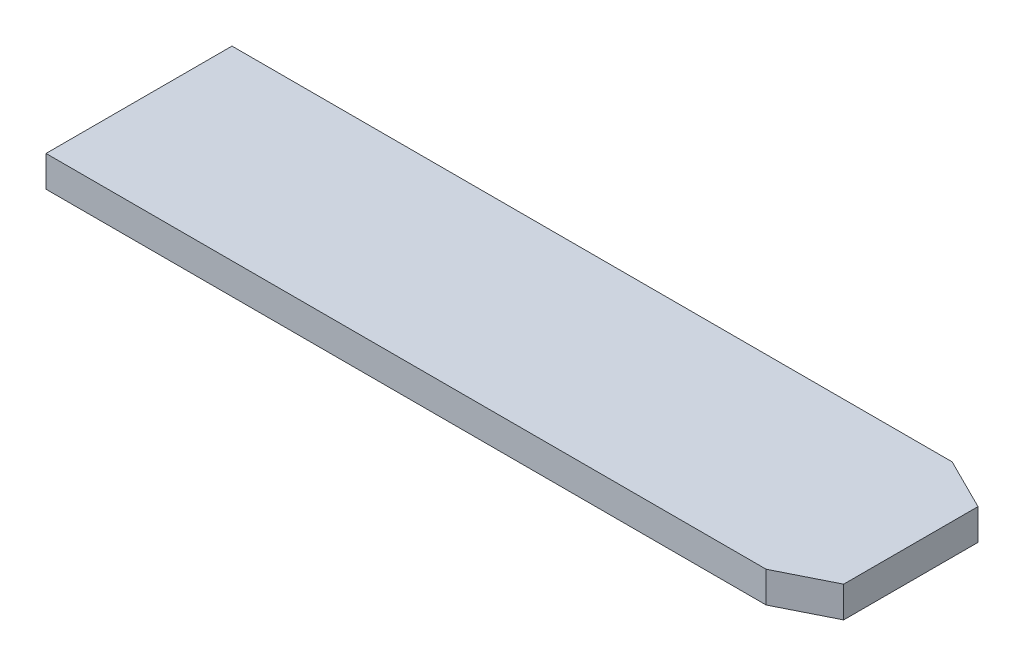
ISO-10303-21;
HEADER;
FILE_DESCRIPTION(('STEP AP214'),'2;1');
FILE_NAME('part.step','',(''),(''),'','','');
FILE_SCHEMA(('AUTOMOTIVE_DESIGN { 1 0 10303 214 1 1 1 1 }'));
ENDSEC;
DATA;
#1=APPLICATION_CONTEXT('core data for automotive mechanical design processes');
#2=APPLICATION_PROTOCOL_DEFINITION('international standard','automotive_design',2000,#1);
#3=PRODUCT_CONTEXT('',#1,'mechanical');
#4=PRODUCT('Part','Part','',(#3));
#5=PRODUCT_RELATED_PRODUCT_CATEGORY('part','',(#4));
#6=PRODUCT_DEFINITION_FORMATION('','',#4);
#7=PRODUCT_DEFINITION_CONTEXT('part definition',#1,'design');
#8=PRODUCT_DEFINITION('design','',#6,#7);
#9=PRODUCT_DEFINITION_SHAPE('','',#8);
#10=(LENGTH_UNIT() NAMED_UNIT(*) SI_UNIT(.MILLI.,.METRE.));
#11=(NAMED_UNIT(*) PLANE_ANGLE_UNIT() SI_UNIT($,.RADIAN.));
#12=(NAMED_UNIT(*) SI_UNIT($,.STERADIAN.) SOLID_ANGLE_UNIT());
#13=UNCERTAINTY_MEASURE_WITH_UNIT(LENGTH_MEASURE(1.E-05),#10,'distance_accuracy_value','');
#14=(GEOMETRIC_REPRESENTATION_CONTEXT(3) GLOBAL_UNCERTAINTY_ASSIGNED_CONTEXT((#13)) GLOBAL_UNIT_ASSIGNED_CONTEXT((#10,
#11,#12)) REPRESENTATION_CONTEXT('',''));
#15=CARTESIAN_POINT('',(0.,0.,0.));
#16=DIRECTION('',(0.,0.,1.));
#17=DIRECTION('',(1.,0.,0.));
#18=AXIS2_PLACEMENT_3D('',#15,#16,#17);
#19=CARTESIAN_POINT('',(0.,0.,0.));
#20=DIRECTION('',(0.,-1.,0.));
#21=DIRECTION('',(0.,0.,-1.));
#22=AXIS2_PLACEMENT_3D('',#19,#20,#21);
#23=PLANE('',#22);
#24=DIRECTION('',(0.894427190999916,0.,-0.447213595499957));
#25=VECTOR('',#24,1.);
#26=CARTESIAN_POINT('',(10.57,0.,21.14));
#27=LINE('',#26,#25);
#28=CARTESIAN_POINT('',(34.85,0.,8.99999999999999));
#29=VERTEX_POINT('',#28);
#30=CARTESIAN_POINT('',(39.85,0.,6.5));
#31=VERTEX_POINT('',#30);
#32=EDGE_CURVE('E91',#29,#31,#27,.T.);
#33=ORIENTED_EDGE('',*,*,#32,.F.);
#34=DIRECTION('',(-1.,0.,0.));
#35=VECTOR('',#34,1.);
#36=CARTESIAN_POINT('',(34.85,0.,8.99999999999999));
#37=LINE('',#36,#35);
#38=CARTESIAN_POINT('',(-34.85,0.,9.));
#39=VERTEX_POINT('',#38);
#40=EDGE_CURVE('E98',#29,#39,#37,.T.);
#41=ORIENTED_EDGE('',*,*,#40,.T.);
#42=DIRECTION('',(0.,0.,-1.));
#43=VECTOR('',#42,1.);
#44=CARTESIAN_POINT('',(-34.85,0.,-9.));
#45=LINE('',#44,#43);
#46=CARTESIAN_POINT('',(-34.85,0.,-9.));
#47=VERTEX_POINT('',#46);
#48=EDGE_CURVE('E71',#39,#47,#45,.T.);
#49=ORIENTED_EDGE('',*,*,#48,.T.);
#50=DIRECTION('',(1.,0.,0.));
#51=VECTOR('',#50,1.);
#52=CARTESIAN_POINT('',(34.85,0.,-9.00000000000001));
#53=LINE('',#52,#51);
#54=CARTESIAN_POINT('',(34.85,0.,-9.00000000000001));
#55=VERTEX_POINT('',#54);
#56=EDGE_CURVE('E20',#47,#55,#53,.T.);
#57=ORIENTED_EDGE('',*,*,#56,.T.);
#58=DIRECTION('',(0.894427190999915,0.,0.447213595499959));
#59=VECTOR('',#58,1.);
#60=CARTESIAN_POINT('',(10.5700000000001,0.,-21.14));
#61=LINE('',#60,#59);
#62=CARTESIAN_POINT('',(39.85,0.,-6.50000000000001));
#63=VERTEX_POINT('',#62);
#64=EDGE_CURVE('E68',#55,#63,#61,.T.);
#65=ORIENTED_EDGE('',*,*,#64,.T.);
#66=DIRECTION('',(0.,0.,-1.));
#67=VECTOR('',#66,1.);
#68=CARTESIAN_POINT('',(39.85,0.,0.));
#69=LINE('',#68,#67);
#70=EDGE_CURVE('E89',#31,#63,#69,.T.);
#71=ORIENTED_EDGE('',*,*,#70,.F.);
#72=EDGE_LOOP('',(#33,#41,#49,#57,#65,#71));
#73=FACE_BOUND('',#72,.T.);
#74=ADVANCED_FACE('F17',(#73),#23,.T.);
#75=CARTESIAN_POINT('',(34.85,3.,-9.00000000000001));
#76=DIRECTION('',(0.,0.,1.));
#77=DIRECTION('',(1.,0.,0.));
#78=AXIS2_PLACEMENT_3D('',#75,#76,#77);
#79=PLANE('',#78);
#80=DIRECTION('',(0.,1.,0.));
#81=VECTOR('',#80,1.);
#82=CARTESIAN_POINT('',(-34.85,3.,-9.));
#83=LINE('',#82,#81);
#84=CARTESIAN_POINT('',(-34.85,3.,-9.));
#85=VERTEX_POINT('',#84);
#86=EDGE_CURVE('E100',#47,#85,#83,.T.);
#87=ORIENTED_EDGE('',*,*,#86,.T.);
#88=DIRECTION('',(1.,0.,0.));
#89=VECTOR('',#88,1.);
#90=CARTESIAN_POINT('',(0.,3.,-9.));
#91=LINE('',#90,#89);
#92=CARTESIAN_POINT('',(34.85,3.,-9.00000000000001));
#93=VERTEX_POINT('',#92);
#94=EDGE_CURVE('E86',#85,#93,#91,.T.);
#95=ORIENTED_EDGE('',*,*,#94,.T.);
#96=DIRECTION('',(0.,1.,0.));
#97=VECTOR('',#96,1.);
#98=CARTESIAN_POINT('',(34.85,0.,-9.00000000000002));
#99=LINE('',#98,#97);
#100=EDGE_CURVE('E76',#93,#55,#99,.F.);
#101=ORIENTED_EDGE('',*,*,#100,.T.);
#102=ORIENTED_EDGE('',*,*,#56,.F.);
#103=EDGE_LOOP('',(#87,#95,#101,#102));
#104=FACE_BOUND('',#103,.T.);
#105=ADVANCED_FACE('F85',(#104),#79,.F.);
#106=CARTESIAN_POINT('',(10.5700000000001,0.,-21.14));
#107=DIRECTION('',(-0.447213595499959,0.,0.894427190999915));
#108=DIRECTION('',(0.894427190999915,0.,0.447213595499959));
#109=AXIS2_PLACEMENT_3D('',#106,#107,#108);
#110=PLANE('',#109);
#111=ORIENTED_EDGE('',*,*,#100,.F.);
#112=DIRECTION('',(0.894427190999916,0.,0.447213595499959));
#113=VECTOR('',#112,1.);
#114=CARTESIAN_POINT('',(34.85,3.,-9.00000000000001));
#115=LINE('',#114,#113);
#116=CARTESIAN_POINT('',(39.85,3.,-6.50000000000001));
#117=VERTEX_POINT('',#116);
#118=EDGE_CURVE('E105',#93,#117,#115,.T.);
#119=ORIENTED_EDGE('',*,*,#118,.T.);
#120=DIRECTION('',(0.,1.,0.));
#121=VECTOR('',#120,1.);
#122=CARTESIAN_POINT('',(39.85,0.,-6.5));
#123=LINE('',#122,#121);
#124=EDGE_CURVE('E82',#63,#117,#123,.T.);
#125=ORIENTED_EDGE('',*,*,#124,.F.);
#126=ORIENTED_EDGE('',*,*,#64,.F.);
#127=EDGE_LOOP('',(#111,#119,#125,#126));
#128=FACE_BOUND('',#127,.T.);
#129=ADVANCED_FACE('F79',(#128),#110,.F.);
#130=CARTESIAN_POINT('',(39.85,0.,0.));
#131=DIRECTION('',(1.,0.,0.));
#132=DIRECTION('',(0.,0.,-1.));
#133=AXIS2_PLACEMENT_3D('',#130,#131,#132);
#134=PLANE('',#133);
#135=DIRECTION('',(0.,1.,0.));
#136=VECTOR('',#135,1.);
#137=CARTESIAN_POINT('',(39.85,0.,6.5));
#138=LINE('',#137,#136);
#139=CARTESIAN_POINT('',(39.85,3.,6.5));
#140=VERTEX_POINT('',#139);
#141=EDGE_CURVE('E93',#31,#140,#138,.T.);
#142=ORIENTED_EDGE('',*,*,#141,.F.);
#143=ORIENTED_EDGE('',*,*,#70,.T.);
#144=ORIENTED_EDGE('',*,*,#124,.T.);
#145=DIRECTION('',(0.,0.,-1.));
#146=VECTOR('',#145,1.);
#147=CARTESIAN_POINT('',(39.85,3.,0.));
#148=LINE('',#147,#146);
#149=EDGE_CURVE('E107',#117,#140,#148,.F.);
#150=ORIENTED_EDGE('',*,*,#149,.T.);
#151=EDGE_LOOP('',(#142,#143,#144,#150));
#152=FACE_BOUND('',#151,.T.);
#153=ADVANCED_FACE('F126',(#152),#134,.T.);
#154=CARTESIAN_POINT('',(10.57,0.,21.14));
#155=DIRECTION('',(0.447213595499957,0.,0.894427190999916));
#156=DIRECTION('',(0.894427190999916,0.,-0.447213595499957));
#157=AXIS2_PLACEMENT_3D('',#154,#155,#156);
#158=PLANE('',#157);
#159=ORIENTED_EDGE('',*,*,#32,.T.);
#160=ORIENTED_EDGE('',*,*,#141,.T.);
#161=DIRECTION('',(-0.894427190999917,0.,0.447213595499957));
#162=VECTOR('',#161,1.);
#163=CARTESIAN_POINT('',(39.85,3.,6.5));
#164=LINE('',#163,#162);
#165=CARTESIAN_POINT('',(34.85,3.,8.99999999999999));
#166=VERTEX_POINT('',#165);
#167=EDGE_CURVE('E110',#140,#166,#164,.T.);
#168=ORIENTED_EDGE('',*,*,#167,.T.);
#169=DIRECTION('',(0.,1.,0.));
#170=VECTOR('',#169,1.);
#171=CARTESIAN_POINT('',(34.85,3.,8.99999999999999));
#172=LINE('',#171,#170);
#173=EDGE_CURVE('E95',#166,#29,#172,.F.);
#174=ORIENTED_EDGE('',*,*,#173,.T.);
#175=EDGE_LOOP('',(#159,#160,#168,#174));
#176=FACE_BOUND('',#175,.T.);
#177=ADVANCED_FACE('F123',(#176),#158,.T.);
#178=CARTESIAN_POINT('',(34.85,3.,8.99999999999999));
#179=DIRECTION('',(0.,0.,-1.));
#180=DIRECTION('',(-1.,0.,0.));
#181=AXIS2_PLACEMENT_3D('',#178,#179,#180);
#182=PLANE('',#181);
#183=ORIENTED_EDGE('',*,*,#173,.F.);
#184=DIRECTION('',(1.,0.,0.));
#185=VECTOR('',#184,1.);
#186=CARTESIAN_POINT('',(0.,3.,8.99999999999999));
#187=LINE('',#186,#185);
#188=CARTESIAN_POINT('',(-34.85,3.,9.));
#189=VERTEX_POINT('',#188);
#190=EDGE_CURVE('E26',#166,#189,#187,.F.);
#191=ORIENTED_EDGE('',*,*,#190,.T.);
#192=DIRECTION('',(0.,1.,0.));
#193=VECTOR('',#192,1.);
#194=CARTESIAN_POINT('',(-34.85,3.,9.00000000000001));
#195=LINE('',#194,#193);
#196=EDGE_CURVE('E34',#189,#39,#195,.F.);
#197=ORIENTED_EDGE('',*,*,#196,.T.);
#198=ORIENTED_EDGE('',*,*,#40,.F.);
#199=EDGE_LOOP('',(#183,#191,#197,#198));
#200=FACE_BOUND('',#199,.T.);
#201=ADVANCED_FACE('F116',(#200),#182,.F.);
#202=CARTESIAN_POINT('',(-34.85,3.,-9.));
#203=DIRECTION('',(1.,0.,0.));
#204=DIRECTION('',(0.,0.,-1.));
#205=AXIS2_PLACEMENT_3D('',#202,#203,#204);
#206=PLANE('',#205);
#207=ORIENTED_EDGE('',*,*,#196,.F.);
#208=DIRECTION('',(0.,0.,-1.));
#209=VECTOR('',#208,1.);
#210=CARTESIAN_POINT('',(-34.85,3.,0.));
#211=LINE('',#210,#209);
#212=EDGE_CURVE('E11',#189,#85,#211,.T.);
#213=ORIENTED_EDGE('',*,*,#212,.T.);
#214=ORIENTED_EDGE('',*,*,#86,.F.);
#215=ORIENTED_EDGE('',*,*,#48,.F.);
#216=EDGE_LOOP('',(#207,#213,#214,#215));
#217=FACE_BOUND('',#216,.T.);
#218=ADVANCED_FACE('F127',(#217),#206,.F.);
#219=CARTESIAN_POINT('',(0.,3.,0.));
#220=DIRECTION('',(0.,-1.,0.));
#221=DIRECTION('',(0.,0.,-1.));
#222=AXIS2_PLACEMENT_3D('',#219,#220,#221);
#223=PLANE('',#222);
#224=ORIENTED_EDGE('',*,*,#190,.F.);
#225=ORIENTED_EDGE('',*,*,#167,.F.);
#226=ORIENTED_EDGE('',*,*,#149,.F.);
#227=ORIENTED_EDGE('',*,*,#118,.F.);
#228=ORIENTED_EDGE('',*,*,#94,.F.);
#229=ORIENTED_EDGE('',*,*,#212,.F.);
#230=EDGE_LOOP('',(#224,#225,#226,#227,#228,#229));
#231=FACE_BOUND('',#230,.T.);
#232=ADVANCED_FACE('F120',(#231),#223,.F.);
#233=CLOSED_SHELL('',(#74,#105,#129,#153,#177,#201,#218,#232));
#234=MANIFOLD_SOLID_BREP('B1',#233);
#235=ADVANCED_BREP_SHAPE_REPRESENTATION('',(#18,#234),#14);
#236=SHAPE_DEFINITION_REPRESENTATION(#9,#235);
ENDSEC;
END-ISO-10303-21;
